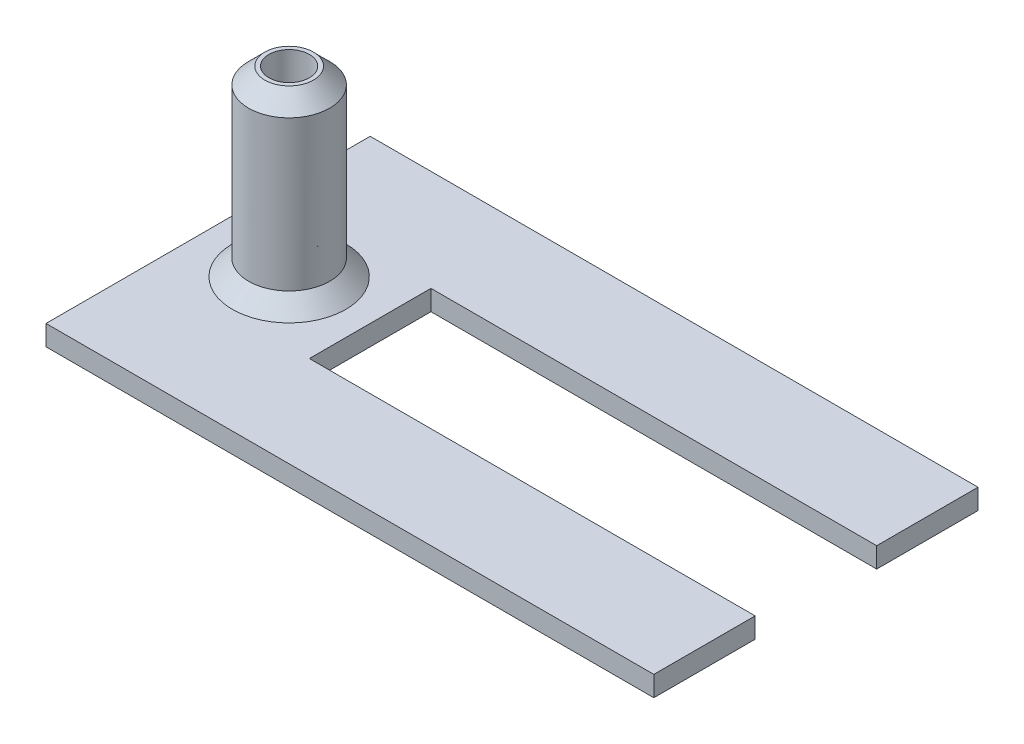
ISO-10303-21;
HEADER;
FILE_DESCRIPTION(('STEP AP214'),'2;1');
FILE_NAME('part.step','',(''),(''),'','','');
FILE_SCHEMA(('AUTOMOTIVE_DESIGN { 1 0 10303 214 1 1 1 1 }'));
ENDSEC;
DATA;
#1=APPLICATION_CONTEXT('core data for automotive mechanical design processes');
#2=APPLICATION_PROTOCOL_DEFINITION('international standard','automotive_design',2000,#1);
#3=PRODUCT_CONTEXT('',#1,'mechanical');
#4=PRODUCT('Part','Part','',(#3));
#5=PRODUCT_RELATED_PRODUCT_CATEGORY('part','',(#4));
#6=PRODUCT_DEFINITION_FORMATION('','',#4);
#7=PRODUCT_DEFINITION_CONTEXT('part definition',#1,'design');
#8=PRODUCT_DEFINITION('design','',#6,#7);
#9=PRODUCT_DEFINITION_SHAPE('','',#8);
#10=(LENGTH_UNIT() NAMED_UNIT(*) SI_UNIT(.MILLI.,.METRE.));
#11=(NAMED_UNIT(*) PLANE_ANGLE_UNIT() SI_UNIT($,.RADIAN.));
#12=(NAMED_UNIT(*) SI_UNIT($,.STERADIAN.) SOLID_ANGLE_UNIT());
#13=UNCERTAINTY_MEASURE_WITH_UNIT(LENGTH_MEASURE(1.E-05),#10,'distance_accuracy_value','');
#14=(GEOMETRIC_REPRESENTATION_CONTEXT(3) GLOBAL_UNCERTAINTY_ASSIGNED_CONTEXT((#13)) GLOBAL_UNIT_ASSIGNED_CONTEXT((#10,
#11,#12)) REPRESENTATION_CONTEXT('',''));
#15=CARTESIAN_POINT('',(0.,0.,0.));
#16=DIRECTION('',(0.,0.,1.));
#17=DIRECTION('',(1.,0.,0.));
#18=AXIS2_PLACEMENT_3D('',#15,#16,#17);
#19=CARTESIAN_POINT('',(-4.,1.,-8.));
#20=DIRECTION('',(0.,0.,1.));
#21=DIRECTION('',(1.,0.,0.));
#22=AXIS2_PLACEMENT_3D('',#19,#20,#21);
#23=PLANE('',#22);
#24=DIRECTION('',(-1.,0.,0.));
#25=VECTOR('',#24,1.);
#26=CARTESIAN_POINT('',(-4.,0.,-8.));
#27=LINE('',#26,#25);
#28=CARTESIAN_POINT('',(26.,0.,-8.));
#29=VERTEX_POINT('',#28);
#30=CARTESIAN_POINT('',(-4.,0.,-8.));
#31=VERTEX_POINT('',#30);
#32=EDGE_CURVE('E159',#29,#31,#27,.T.);
#33=ORIENTED_EDGE('',*,*,#32,.T.);
#34=DIRECTION('',(0.,-1.,0.));
#35=VECTOR('',#34,1.);
#36=CARTESIAN_POINT('',(-4.,1.,-8.));
#37=LINE('',#36,#35);
#38=CARTESIAN_POINT('',(-4.,1.,-8.));
#39=VERTEX_POINT('',#38);
#40=EDGE_CURVE('E200',#39,#31,#37,.T.);
#41=ORIENTED_EDGE('',*,*,#40,.F.);
#42=DIRECTION('',(-1.,0.,0.));
#43=VECTOR('',#42,1.);
#44=CARTESIAN_POINT('',(-4.,1.,-8.));
#45=LINE('',#44,#43);
#46=CARTESIAN_POINT('',(26.,1.,-8.));
#47=VERTEX_POINT('',#46);
#48=EDGE_CURVE('E181',#47,#39,#45,.T.);
#49=ORIENTED_EDGE('',*,*,#48,.F.);
#50=DIRECTION('',(0.,-1.,0.));
#51=VECTOR('',#50,1.);
#52=CARTESIAN_POINT('',(26.,1.,-8.));
#53=LINE('',#52,#51);
#54=EDGE_CURVE('E155',#47,#29,#53,.T.);
#55=ORIENTED_EDGE('',*,*,#54,.T.);
#56=EDGE_LOOP('',(#33,#41,#49,#55));
#57=FACE_BOUND('',#56,.T.);
#58=ADVANCED_FACE('F40',(#57),#23,.F.);
#59=CARTESIAN_POINT('',(-4.,1.,8.));
#60=DIRECTION('',(1.,0.,0.));
#61=DIRECTION('',(0.,0.,-1.));
#62=AXIS2_PLACEMENT_3D('',#59,#60,#61);
#63=PLANE('',#62);
#64=DIRECTION('',(0.,0.,1.));
#65=VECTOR('',#64,1.);
#66=CARTESIAN_POINT('',(-4.,0.,8.));
#67=LINE('',#66,#65);
#68=CARTESIAN_POINT('',(-4.,0.,8.));
#69=VERTEX_POINT('',#68);
#70=EDGE_CURVE('E163',#31,#69,#67,.T.);
#71=ORIENTED_EDGE('',*,*,#70,.T.);
#72=DIRECTION('',(0.,-1.,0.));
#73=VECTOR('',#72,1.);
#74=CARTESIAN_POINT('',(-4.,1.,8.));
#75=LINE('',#74,#73);
#76=CARTESIAN_POINT('',(-4.,1.,8.));
#77=VERTEX_POINT('',#76);
#78=EDGE_CURVE('E196',#77,#69,#75,.T.);
#79=ORIENTED_EDGE('',*,*,#78,.F.);
#80=DIRECTION('',(0.,0.,1.));
#81=VECTOR('',#80,1.);
#82=CARTESIAN_POINT('',(-4.,1.,8.));
#83=LINE('',#82,#81);
#84=EDGE_CURVE('E111',#39,#77,#83,.T.);
#85=ORIENTED_EDGE('',*,*,#84,.F.);
#86=ORIENTED_EDGE('',*,*,#40,.T.);
#87=EDGE_LOOP('',(#71,#79,#85,#86));
#88=FACE_BOUND('',#87,.T.);
#89=ADVANCED_FACE('F283',(#88),#63,.F.);
#90=CARTESIAN_POINT('',(26.,1.,8.));
#91=DIRECTION('',(0.,0.,-1.));
#92=DIRECTION('',(-1.,0.,0.));
#93=AXIS2_PLACEMENT_3D('',#90,#91,#92);
#94=PLANE('',#93);
#95=DIRECTION('',(1.,0.,0.));
#96=VECTOR('',#95,1.);
#97=CARTESIAN_POINT('',(26.,0.,8.));
#98=LINE('',#97,#96);
#99=CARTESIAN_POINT('',(26.,0.,8.));
#100=VERTEX_POINT('',#99);
#101=EDGE_CURVE('E167',#69,#100,#98,.T.);
#102=ORIENTED_EDGE('',*,*,#101,.T.);
#103=DIRECTION('',(0.,-1.,0.));
#104=VECTOR('',#103,1.);
#105=CARTESIAN_POINT('',(26.,1.,8.));
#106=LINE('',#105,#104);
#107=CARTESIAN_POINT('',(26.,1.,8.));
#108=VERTEX_POINT('',#107);
#109=EDGE_CURVE('E192',#108,#100,#106,.T.);
#110=ORIENTED_EDGE('',*,*,#109,.F.);
#111=DIRECTION('',(1.,0.,0.));
#112=VECTOR('',#111,1.);
#113=CARTESIAN_POINT('',(26.,1.,8.));
#114=LINE('',#113,#112);
#115=EDGE_CURVE('E250',#77,#108,#114,.T.);
#116=ORIENTED_EDGE('',*,*,#115,.F.);
#117=ORIENTED_EDGE('',*,*,#78,.T.);
#118=EDGE_LOOP('',(#102,#110,#116,#117));
#119=FACE_BOUND('',#118,.T.);
#120=ADVANCED_FACE('F288',(#119),#94,.F.);
#121=CARTESIAN_POINT('',(26.,1.,3.));
#122=DIRECTION('',(-1.,0.,0.));
#123=DIRECTION('',(0.,0.,1.));
#124=AXIS2_PLACEMENT_3D('',#121,#122,#123);
#125=PLANE('',#124);
#126=DIRECTION('',(0.,0.,-1.));
#127=VECTOR('',#126,1.);
#128=CARTESIAN_POINT('',(26.,0.,3.));
#129=LINE('',#128,#127);
#130=CARTESIAN_POINT('',(26.,0.,3.));
#131=VERTEX_POINT('',#130);
#132=EDGE_CURVE('E169',#100,#131,#129,.T.);
#133=ORIENTED_EDGE('',*,*,#132,.T.);
#134=DIRECTION('',(0.,-1.,0.));
#135=VECTOR('',#134,1.);
#136=CARTESIAN_POINT('',(26.,1.,3.));
#137=LINE('',#136,#135);
#138=CARTESIAN_POINT('',(26.,1.,3.));
#139=VERTEX_POINT('',#138);
#140=EDGE_CURVE('E188',#139,#131,#137,.T.);
#141=ORIENTED_EDGE('',*,*,#140,.F.);
#142=DIRECTION('',(0.,0.,-1.));
#143=VECTOR('',#142,1.);
#144=CARTESIAN_POINT('',(26.,1.,3.));
#145=LINE('',#144,#143);
#146=EDGE_CURVE('E253',#108,#139,#145,.T.);
#147=ORIENTED_EDGE('',*,*,#146,.F.);
#148=ORIENTED_EDGE('',*,*,#109,.T.);
#149=EDGE_LOOP('',(#133,#141,#147,#148));
#150=FACE_BOUND('',#149,.T.);
#151=ADVANCED_FACE('F261',(#150),#125,.F.);
#152=CARTESIAN_POINT('',(4.,1.,3.));
#153=DIRECTION('',(0.,0.,1.));
#154=DIRECTION('',(1.,0.,0.));
#155=AXIS2_PLACEMENT_3D('',#152,#153,#154);
#156=PLANE('',#155);
#157=DIRECTION('',(-1.,0.,0.));
#158=VECTOR('',#157,1.);
#159=CARTESIAN_POINT('',(4.,0.,3.));
#160=LINE('',#159,#158);
#161=CARTESIAN_POINT('',(4.,0.,3.));
#162=VERTEX_POINT('',#161);
#163=EDGE_CURVE('E172',#131,#162,#160,.T.);
#164=ORIENTED_EDGE('',*,*,#163,.T.);
#165=DIRECTION('',(0.,-1.,0.));
#166=VECTOR('',#165,1.);
#167=CARTESIAN_POINT('',(4.,1.,3.));
#168=LINE('',#167,#166);
#169=CARTESIAN_POINT('',(4.,1.,3.));
#170=VERTEX_POINT('',#169);
#171=EDGE_CURVE('E146',#170,#162,#168,.T.);
#172=ORIENTED_EDGE('',*,*,#171,.F.);
#173=DIRECTION('',(-1.,0.,0.));
#174=VECTOR('',#173,1.);
#175=CARTESIAN_POINT('',(4.,1.,3.));
#176=LINE('',#175,#174);
#177=EDGE_CURVE('E135',#139,#170,#176,.T.);
#178=ORIENTED_EDGE('',*,*,#177,.F.);
#179=ORIENTED_EDGE('',*,*,#140,.T.);
#180=EDGE_LOOP('',(#164,#172,#178,#179));
#181=FACE_BOUND('',#180,.T.);
#182=ADVANCED_FACE('F265',(#181),#156,.F.);
#183=CARTESIAN_POINT('',(4.,1.,-3.));
#184=DIRECTION('',(-1.,0.,0.));
#185=DIRECTION('',(0.,0.,1.));
#186=AXIS2_PLACEMENT_3D('',#183,#184,#185);
#187=PLANE('',#186);
#188=DIRECTION('',(0.,0.,-1.));
#189=VECTOR('',#188,1.);
#190=CARTESIAN_POINT('',(4.,0.,-3.));
#191=LINE('',#190,#189);
#192=CARTESIAN_POINT('',(4.,0.,-3.));
#193=VERTEX_POINT('',#192);
#194=EDGE_CURVE('E144',#162,#193,#191,.T.);
#195=ORIENTED_EDGE('',*,*,#194,.T.);
#196=DIRECTION('',(0.,-1.,0.));
#197=VECTOR('',#196,1.);
#198=CARTESIAN_POINT('',(4.,1.,-3.));
#199=LINE('',#198,#197);
#200=CARTESIAN_POINT('',(4.,1.,-3.));
#201=VERTEX_POINT('',#200);
#202=EDGE_CURVE('E141',#201,#193,#199,.T.);
#203=ORIENTED_EDGE('',*,*,#202,.F.);
#204=DIRECTION('',(0.,0.,-1.));
#205=VECTOR('',#204,1.);
#206=CARTESIAN_POINT('',(4.,1.,-3.));
#207=LINE('',#206,#205);
#208=EDGE_CURVE('E129',#170,#201,#207,.T.);
#209=ORIENTED_EDGE('',*,*,#208,.F.);
#210=ORIENTED_EDGE('',*,*,#171,.T.);
#211=EDGE_LOOP('',(#195,#203,#209,#210));
#212=FACE_BOUND('',#211,.T.);
#213=ADVANCED_FACE('F142',(#212),#187,.F.);
#214=CARTESIAN_POINT('',(26.,1.,-3.));
#215=DIRECTION('',(0.,0.,-1.));
#216=DIRECTION('',(-1.,0.,0.));
#217=AXIS2_PLACEMENT_3D('',#214,#215,#216);
#218=PLANE('',#217);
#219=DIRECTION('',(1.,0.,0.));
#220=VECTOR('',#219,1.);
#221=CARTESIAN_POINT('',(26.,0.,-3.));
#222=LINE('',#221,#220);
#223=CARTESIAN_POINT('',(26.,0.,-3.));
#224=VERTEX_POINT('',#223);
#225=EDGE_CURVE('E95',#193,#224,#222,.T.);
#226=ORIENTED_EDGE('',*,*,#225,.T.);
#227=DIRECTION('',(0.,-1.,0.));
#228=VECTOR('',#227,1.);
#229=CARTESIAN_POINT('',(26.,1.,-3.));
#230=LINE('',#229,#228);
#231=CARTESIAN_POINT('',(26.,1.,-3.));
#232=VERTEX_POINT('',#231);
#233=EDGE_CURVE('E147',#232,#224,#230,.T.);
#234=ORIENTED_EDGE('',*,*,#233,.F.);
#235=DIRECTION('',(1.,0.,0.));
#236=VECTOR('',#235,1.);
#237=CARTESIAN_POINT('',(26.,1.,-3.));
#238=LINE('',#237,#236);
#239=EDGE_CURVE('E133',#201,#232,#238,.T.);
#240=ORIENTED_EDGE('',*,*,#239,.F.);
#241=ORIENTED_EDGE('',*,*,#202,.T.);
#242=EDGE_LOOP('',(#226,#234,#240,#241));
#243=FACE_BOUND('',#242,.T.);
#244=ADVANCED_FACE('F149',(#243),#218,.F.);
#245=CARTESIAN_POINT('',(26.,1.,-8.));
#246=DIRECTION('',(-1.,0.,0.));
#247=DIRECTION('',(0.,0.,1.));
#248=AXIS2_PLACEMENT_3D('',#245,#246,#247);
#249=PLANE('',#248);
#250=DIRECTION('',(0.,0.,-1.));
#251=VECTOR('',#250,1.);
#252=CARTESIAN_POINT('',(26.,0.,-8.));
#253=LINE('',#252,#251);
#254=EDGE_CURVE('E102',#224,#29,#253,.T.);
#255=ORIENTED_EDGE('',*,*,#254,.T.);
#256=ORIENTED_EDGE('',*,*,#54,.F.);
#257=DIRECTION('',(0.,0.,-1.));
#258=VECTOR('',#257,1.);
#259=CARTESIAN_POINT('',(26.,1.,-8.));
#260=LINE('',#259,#258);
#261=EDGE_CURVE('E61',#232,#47,#260,.T.);
#262=ORIENTED_EDGE('',*,*,#261,.F.);
#263=ORIENTED_EDGE('',*,*,#233,.T.);
#264=EDGE_LOOP('',(#255,#256,#262,#263));
#265=FACE_BOUND('',#264,.T.);
#266=ADVANCED_FACE('F272',(#265),#249,.F.);
#267=CARTESIAN_POINT('',(0.,1.,0.));
#268=DIRECTION('',(0.,-1.,0.));
#269=DIRECTION('',(0.,0.,-1.));
#270=AXIS2_PLACEMENT_3D('',#267,#268,#269);
#271=PLANE('',#270);
#272=CARTESIAN_POINT('',(0.,1.,0.));
#273=DIRECTION('',(0.,-1.,0.));
#274=DIRECTION('',(0.,0.,-1.));
#275=AXIS2_PLACEMENT_3D('',#272,#273,#274);
#276=CIRCLE('',#275,2.79999999999999);
#277=CARTESIAN_POINT('',(0.,1.,-2.79999999999999));
#278=VERTEX_POINT('',#277);
#279=EDGE_CURVE('E50',#278,#278,#276,.T.);
#280=ORIENTED_EDGE('',*,*,#279,.T.);
#281=EDGE_LOOP('',(#280));
#282=FACE_BOUND('',#281,.T.);
#283=ORIENTED_EDGE('',*,*,#48,.T.);
#284=ORIENTED_EDGE('',*,*,#84,.T.);
#285=ORIENTED_EDGE('',*,*,#115,.T.);
#286=ORIENTED_EDGE('',*,*,#146,.T.);
#287=ORIENTED_EDGE('',*,*,#177,.T.);
#288=ORIENTED_EDGE('',*,*,#208,.T.);
#289=ORIENTED_EDGE('',*,*,#239,.T.);
#290=ORIENTED_EDGE('',*,*,#261,.T.);
#291=EDGE_LOOP('',(#283,#284,#285,#286,#287,#288,#289,#290));
#292=FACE_BOUND('',#291,.T.);
#293=ADVANCED_FACE('F131',(#282,#292),#271,.F.);
#294=CARTESIAN_POINT('',(0.,0.,0.));
#295=DIRECTION('',(0.,-1.,0.));
#296=DIRECTION('',(0.,0.,-1.));
#297=AXIS2_PLACEMENT_3D('',#294,#295,#296);
#298=PLANE('',#297);
#299=ORIENTED_EDGE('',*,*,#32,.F.);
#300=ORIENTED_EDGE('',*,*,#254,.F.);
#301=ORIENTED_EDGE('',*,*,#225,.F.);
#302=ORIENTED_EDGE('',*,*,#194,.F.);
#303=ORIENTED_EDGE('',*,*,#163,.F.);
#304=ORIENTED_EDGE('',*,*,#132,.F.);
#305=ORIENTED_EDGE('',*,*,#101,.F.);
#306=ORIENTED_EDGE('',*,*,#70,.F.);
#307=EDGE_LOOP('',(#299,#300,#301,#302,#303,#304,#305,#306));
#308=FACE_BOUND('',#307,.T.);
#309=ADVANCED_FACE('F227',(#308),#298,.T.);
#310=CARTESIAN_POINT('',(0.,10.,0.));
#311=DIRECTION('',(0.,-1.,0.));
#312=DIRECTION('',(0.,0.,-1.));
#313=AXIS2_PLACEMENT_3D('',#310,#311,#312);
#314=CYLINDRICAL_SURFACE('',#313,2.);
#315=CARTESIAN_POINT('',(0.,1.8,0.));
#316=DIRECTION('',(0.,-1.,0.));
#317=DIRECTION('',(0.,0.,-1.));
#318=AXIS2_PLACEMENT_3D('',#315,#316,#317);
#319=CIRCLE('',#318,2.);
#320=CARTESIAN_POINT('',(0.,1.8,-2.));
#321=VERTEX_POINT('',#320);
#322=EDGE_CURVE('E207',#321,#321,#319,.F.);
#323=ORIENTED_EDGE('',*,*,#322,.T.);
#324=EDGE_LOOP('',(#323));
#325=FACE_BOUND('',#324,.T.);
#326=CARTESIAN_POINT('',(0.,9.19999999999999,0.));
#327=DIRECTION('',(0.,1.,0.));
#328=DIRECTION('',(0.,0.,1.));
#329=AXIS2_PLACEMENT_3D('',#326,#327,#328);
#330=CIRCLE('',#329,2.);
#331=CARTESIAN_POINT('',(0.,9.19999999999999,2.));
#332=VERTEX_POINT('',#331);
#333=EDGE_CURVE('E203',#332,#332,#330,.F.);
#334=ORIENTED_EDGE('',*,*,#333,.T.);
#335=EDGE_LOOP('',(#334));
#336=FACE_BOUND('',#335,.T.);
#337=ADVANCED_FACE('F223',(#325,#336),#314,.T.);
#338=CARTESIAN_POINT('',(0.,10.,0.));
#339=DIRECTION('',(0.,-1.,0.));
#340=DIRECTION('',(0.,0.,-1.));
#341=AXIS2_PLACEMENT_3D('',#338,#339,#340);
#342=CYLINDRICAL_SURFACE('',#341,1.);
#343=CARTESIAN_POINT('',(0.,10.,0.));
#344=DIRECTION('',(0.,1.,0.));
#345=DIRECTION('',(0.,0.,1.));
#346=AXIS2_PLACEMENT_3D('',#343,#344,#345);
#347=CIRCLE('',#346,1.);
#348=CARTESIAN_POINT('',(0.,10.,1.));
#349=VERTEX_POINT('',#348);
#350=EDGE_CURVE('E241',#349,#349,#347,.T.);
#351=ORIENTED_EDGE('',*,*,#350,.T.);
#352=EDGE_LOOP('',(#351));
#353=FACE_BOUND('',#352,.T.);
#354=CARTESIAN_POINT('',(0.,0.999999999999999,0.));
#355=DIRECTION('',(0.,-1.,0.));
#356=DIRECTION('',(0.,0.,-1.));
#357=AXIS2_PLACEMENT_3D('',#354,#355,#356);
#358=CIRCLE('',#357,1.);
#359=CARTESIAN_POINT('',(0.,0.999999999999999,-1.));
#360=VERTEX_POINT('',#359);
#361=EDGE_CURVE('E164',#360,#360,#358,.F.);
#362=ORIENTED_EDGE('',*,*,#361,.F.);
#363=EDGE_LOOP('',(#362));
#364=FACE_BOUND('',#363,.T.);
#365=ADVANCED_FACE('F226',(#353,#364),#342,.F.);
#366=CARTESIAN_POINT('',(0.,10.,0.));
#367=DIRECTION('',(0.,1.,0.));
#368=DIRECTION('',(0.,0.,1.));
#369=AXIS2_PLACEMENT_3D('',#366,#367,#368);
#370=PLANE('',#369);
#371=CARTESIAN_POINT('',(0.,10.,0.));
#372=DIRECTION('',(0.,1.,0.));
#373=DIRECTION('',(0.,0.,1.));
#374=AXIS2_PLACEMENT_3D('',#371,#372,#373);
#375=CIRCLE('',#374,1.2);
#376=CARTESIAN_POINT('',(0.,10.,1.2));
#377=VERTEX_POINT('',#376);
#378=EDGE_CURVE('E11',#377,#377,#375,.T.);
#379=ORIENTED_EDGE('',*,*,#378,.T.);
#380=EDGE_LOOP('',(#379));
#381=FACE_BOUND('',#380,.T.);
#382=ORIENTED_EDGE('',*,*,#350,.F.);
#383=EDGE_LOOP('',(#382));
#384=FACE_BOUND('',#383,.T.);
#385=ADVANCED_FACE('F235',(#381,#384),#370,.T.);
#386=ORIENTED_EDGE('',*,*,#361,.T.);
#387=EDGE_LOOP('',(#386));
#388=FACE_BOUND('',#387,.T.);
#389=ADVANCED_FACE('F220',(#388),#271,.F.);
#390=CARTESIAN_POINT('',(0.,1.8,0.));
#391=DIRECTION('',(0.,-1.,0.));
#392=DIRECTION('',(0.,0.,-1.));
#393=AXIS2_PLACEMENT_3D('',#390,#391,#392);
#394=CONICAL_SURFACE('',#393,2.,0.785398163397442);
#395=ORIENTED_EDGE('',*,*,#279,.F.);
#396=EDGE_LOOP('',(#395));
#397=FACE_BOUND('',#396,.T.);
#398=ORIENTED_EDGE('',*,*,#322,.F.);
#399=EDGE_LOOP('',(#398));
#400=FACE_BOUND('',#399,.T.);
#401=ADVANCED_FACE('F217',(#397,#400),#394,.T.);
#402=CARTESIAN_POINT('',(0.,10.,0.));
#403=DIRECTION('',(0.,-1.,0.));
#404=DIRECTION('',(0.,0.,-1.));
#405=AXIS2_PLACEMENT_3D('',#402,#403,#404);
#406=CONICAL_SURFACE('',#405,1.2,0.785398163397446);
#407=ORIENTED_EDGE('',*,*,#333,.F.);
#408=EDGE_LOOP('',(#407));
#409=FACE_BOUND('',#408,.T.);
#410=ORIENTED_EDGE('',*,*,#378,.F.);
#411=EDGE_LOOP('',(#410));
#412=FACE_BOUND('',#411,.T.);
#413=ADVANCED_FACE('F42',(#409,#412),#406,.T.);
#414=CLOSED_SHELL('',(#58,#89,#120,#151,#182,#213,#244,#266,#293,#309,#337,#365,#385,#389,#401,#413));
#415=MANIFOLD_SOLID_BREP('B2',#414);
#416=ADVANCED_BREP_SHAPE_REPRESENTATION('',(#18,#415),#14);
#417=SHAPE_DEFINITION_REPRESENTATION(#9,#416);
ENDSEC;
END-ISO-10303-21;
